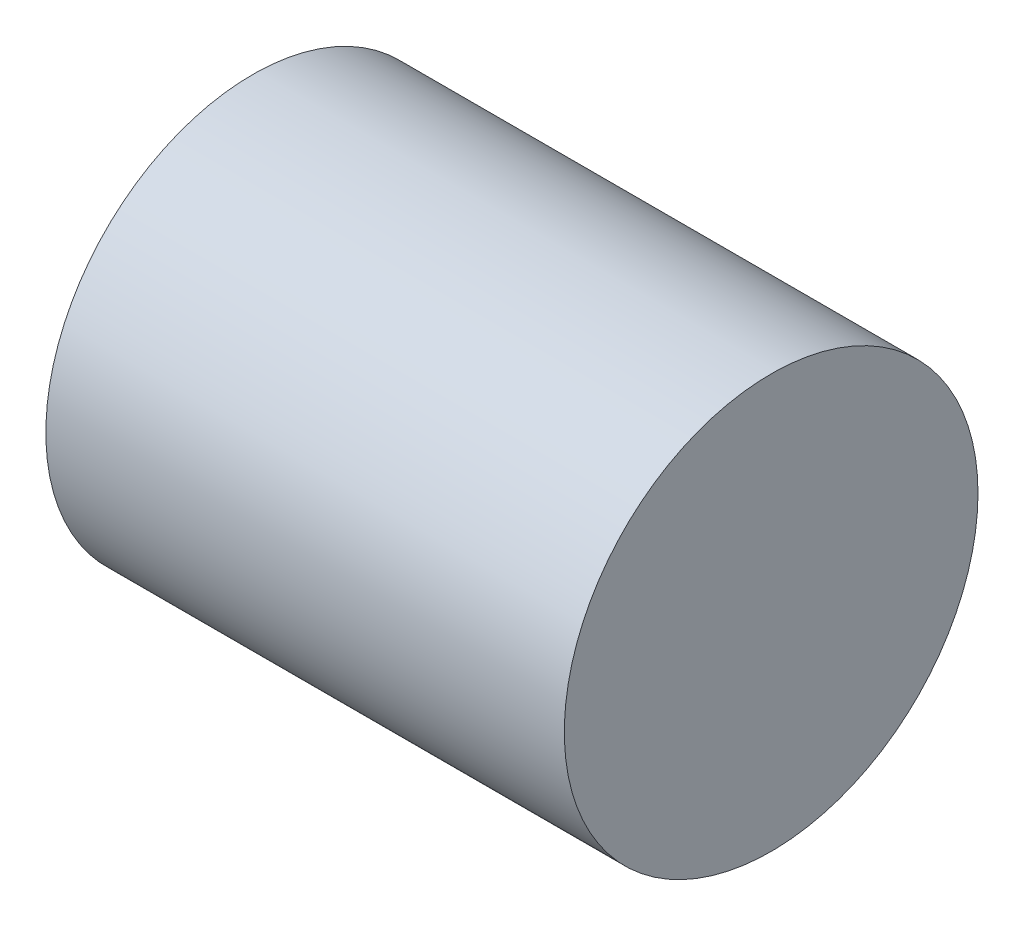
ISO-10303-21;
HEADER;
FILE_DESCRIPTION(('STEP AP214'),'2;1');
FILE_NAME('part.step','',(''),(''),'','','');
FILE_SCHEMA(('AUTOMOTIVE_DESIGN { 1 0 10303 214 1 1 1 1 }'));
ENDSEC;
DATA;
#1=APPLICATION_CONTEXT('core data for automotive mechanical design processes');
#2=APPLICATION_PROTOCOL_DEFINITION('international standard','automotive_design',2000,#1);
#3=PRODUCT_CONTEXT('',#1,'mechanical');
#4=PRODUCT('Part','Part','',(#3));
#5=PRODUCT_RELATED_PRODUCT_CATEGORY('part','',(#4));
#6=PRODUCT_DEFINITION_FORMATION('','',#4);
#7=PRODUCT_DEFINITION_CONTEXT('part definition',#1,'design');
#8=PRODUCT_DEFINITION('design','',#6,#7);
#9=PRODUCT_DEFINITION_SHAPE('','',#8);
#10=(LENGTH_UNIT() NAMED_UNIT(*) SI_UNIT(.MILLI.,.METRE.));
#11=(NAMED_UNIT(*) PLANE_ANGLE_UNIT() SI_UNIT($,.RADIAN.));
#12=(NAMED_UNIT(*) SI_UNIT($,.STERADIAN.) SOLID_ANGLE_UNIT());
#13=UNCERTAINTY_MEASURE_WITH_UNIT(LENGTH_MEASURE(1.E-05),#10,'distance_accuracy_value','');
#14=(GEOMETRIC_REPRESENTATION_CONTEXT(3) GLOBAL_UNCERTAINTY_ASSIGNED_CONTEXT((#13)) GLOBAL_UNIT_ASSIGNED_CONTEXT((#10,
#11,#12)) REPRESENTATION_CONTEXT('',''));
#15=CARTESIAN_POINT('',(0.,0.,0.));
#16=DIRECTION('',(0.,0.,1.));
#17=DIRECTION('',(1.,0.,0.));
#18=AXIS2_PLACEMENT_3D('',#15,#16,#17);
#19=CARTESIAN_POINT('',(2.,0.,0.));
#20=DIRECTION('',(-1.,0.,0.));
#21=DIRECTION('',(0.,0.,1.));
#22=AXIS2_PLACEMENT_3D('',#19,#20,#21);
#23=CYLINDRICAL_SURFACE('',#22,0.797884559999962);
#24=CARTESIAN_POINT('',(2.,0.,0.));
#25=DIRECTION('',(1.,0.,0.));
#26=DIRECTION('',(0.,0.,-1.));
#27=AXIS2_PLACEMENT_3D('',#24,#25,#26);
#28=CIRCLE('',#27,0.797884559999962);
#29=CARTESIAN_POINT('',(2.,0.,-0.797884559999962));
#30=VERTEX_POINT('',#29);
#31=EDGE_CURVE('E10',#30,#30,#28,.T.);
#32=ORIENTED_EDGE('',*,*,#31,.F.);
#33=EDGE_LOOP('',(#32));
#34=FACE_BOUND('',#33,.T.);
#35=CARTESIAN_POINT('',(0.,0.,0.));
#36=DIRECTION('',(1.,0.,0.));
#37=DIRECTION('',(0.,0.,-1.));
#38=AXIS2_PLACEMENT_3D('',#35,#36,#37);
#39=CIRCLE('',#38,0.797884559999962);
#40=CARTESIAN_POINT('',(0.,0.,-0.797884559999962));
#41=VERTEX_POINT('',#40);
#42=EDGE_CURVE('E34',#41,#41,#39,.T.);
#43=ORIENTED_EDGE('',*,*,#42,.T.);
#44=EDGE_LOOP('',(#43));
#45=FACE_BOUND('',#44,.T.);
#46=ADVANCED_FACE('F31',(#34,#45),#23,.T.);
#47=CARTESIAN_POINT('',(2.,0.,0.));
#48=DIRECTION('',(1.,0.,0.));
#49=DIRECTION('',(0.,0.,-1.));
#50=AXIS2_PLACEMENT_3D('',#47,#48,#49);
#51=PLANE('',#50);
#52=ORIENTED_EDGE('',*,*,#31,.T.);
#53=EDGE_LOOP('',(#52));
#54=FACE_BOUND('',#53,.T.);
#55=ADVANCED_FACE('F46',(#54),#51,.T.);
#56=CARTESIAN_POINT('',(0.,0.,0.));
#57=DIRECTION('',(1.,0.,0.));
#58=DIRECTION('',(0.,0.,-1.));
#59=AXIS2_PLACEMENT_3D('',#56,#57,#58);
#60=PLANE('',#59);
#61=ORIENTED_EDGE('',*,*,#42,.F.);
#62=EDGE_LOOP('',(#61));
#63=FACE_BOUND('',#62,.T.);
#64=ADVANCED_FACE('F44',(#63),#60,.F.);
#65=CLOSED_SHELL('',(#46,#55,#64));
#66=MANIFOLD_SOLID_BREP('B2',#65);
#67=ADVANCED_BREP_SHAPE_REPRESENTATION('',(#18,#66),#14);
#68=SHAPE_DEFINITION_REPRESENTATION(#9,#67);
ENDSEC;
END-ISO-10303-21;
